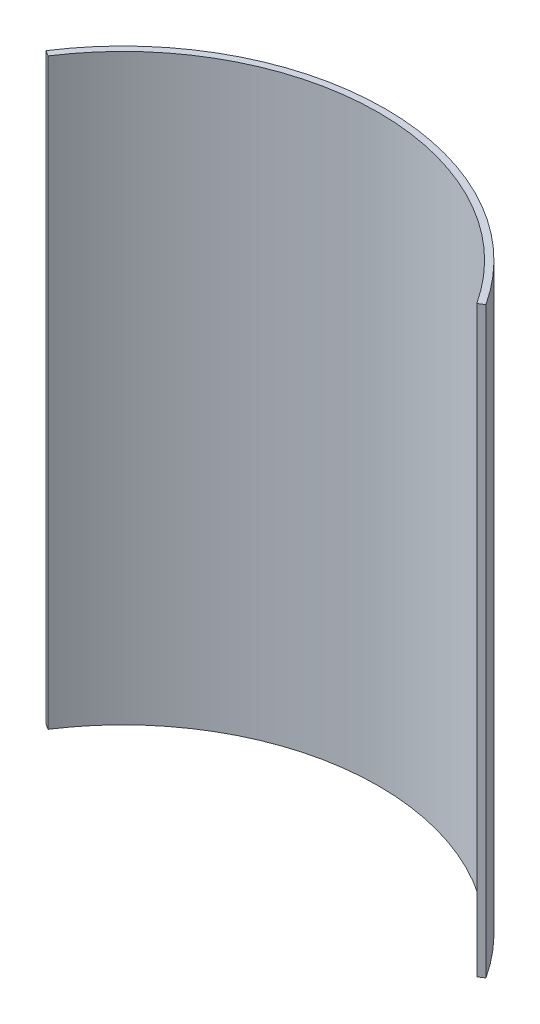
ISO-10303-21;
HEADER;
FILE_DESCRIPTION(('STEP AP214'),'2;1');
FILE_NAME('part.step','',(''),(''),'','','');
FILE_SCHEMA(('AUTOMOTIVE_DESIGN { 1 0 10303 214 1 1 1 1 }'));
ENDSEC;
DATA;
#1=APPLICATION_CONTEXT('core data for automotive mechanical design processes');
#2=APPLICATION_PROTOCOL_DEFINITION('international standard','automotive_design',2000,#1);
#3=PRODUCT_CONTEXT('',#1,'mechanical');
#4=PRODUCT('Part','Part','',(#3));
#5=PRODUCT_RELATED_PRODUCT_CATEGORY('part','',(#4));
#6=PRODUCT_DEFINITION_FORMATION('','',#4);
#7=PRODUCT_DEFINITION_CONTEXT('part definition',#1,'design');
#8=PRODUCT_DEFINITION('design','',#6,#7);
#9=PRODUCT_DEFINITION_SHAPE('','',#8);
#10=(LENGTH_UNIT() NAMED_UNIT(*) SI_UNIT(.MILLI.,.METRE.));
#11=(NAMED_UNIT(*) PLANE_ANGLE_UNIT() SI_UNIT($,.RADIAN.));
#12=(NAMED_UNIT(*) SI_UNIT($,.STERADIAN.) SOLID_ANGLE_UNIT());
#13=UNCERTAINTY_MEASURE_WITH_UNIT(LENGTH_MEASURE(1.E-05),#10,'distance_accuracy_value','');
#14=(GEOMETRIC_REPRESENTATION_CONTEXT(3) GLOBAL_UNCERTAINTY_ASSIGNED_CONTEXT((#13)) GLOBAL_UNIT_ASSIGNED_CONTEXT((#10,
#11,#12)) REPRESENTATION_CONTEXT('',''));
#15=CARTESIAN_POINT('',(0.,0.,0.));
#16=DIRECTION('',(0.,0.,1.));
#17=DIRECTION('',(1.,0.,0.));
#18=AXIS2_PLACEMENT_3D('',#15,#16,#17);
#19=CARTESIAN_POINT('',(0.,-85.5,0.));
#20=DIRECTION('',(0.,1.,0.));
#21=DIRECTION('',(0.,0.,1.));
#22=AXIS2_PLACEMENT_3D('',#19,#20,#21);
#23=CYLINDRICAL_SURFACE('',#22,37.5);
#24=CARTESIAN_POINT('',(0.,0.,0.));
#25=DIRECTION('',(0.,-1.,0.));
#26=DIRECTION('',(0.,0.,1.));
#27=AXIS2_PLACEMENT_3D('',#24,#25,#26);
#28=CIRCLE('',#27,37.5);
#29=CARTESIAN_POINT('',(-31.4300312322926,0.,-20.4549049554652));
#30=VERTEX_POINT('',#29);
#31=CARTESIAN_POINT('',(31.4300312322926,0.,-20.4549049554652));
#32=VERTEX_POINT('',#31);
#33=EDGE_CURVE('E99',#30,#32,#28,.T.);
#34=ORIENTED_EDGE('',*,*,#33,.F.);
#35=DIRECTION('',(0.,1.,0.));
#36=VECTOR('',#35,1.);
#37=CARTESIAN_POINT('',(-31.4300312322926,-85.5,-20.4549049554652));
#38=LINE('',#37,#36);
#39=CARTESIAN_POINT('',(-31.4300312322926,-85.5,-20.4549049554652));
#40=VERTEX_POINT('',#39);
#41=EDGE_CURVE('E11',#40,#30,#38,.T.);
#42=ORIENTED_EDGE('',*,*,#41,.F.);
#43=CARTESIAN_POINT('',(0.,-85.5,0.));
#44=DIRECTION('',(0.,-1.,0.));
#45=DIRECTION('',(0.,0.,1.));
#46=AXIS2_PLACEMENT_3D('',#43,#44,#45);
#47=CIRCLE('',#46,37.5);
#48=CARTESIAN_POINT('',(31.4300312322926,-85.5,-20.4549049554652));
#49=VERTEX_POINT('',#48);
#50=EDGE_CURVE('E93',#40,#49,#47,.T.);
#51=ORIENTED_EDGE('',*,*,#50,.T.);
#52=DIRECTION('',(0.,1.,0.));
#53=VECTOR('',#52,1.);
#54=CARTESIAN_POINT('',(31.4300312322926,-85.5,-20.4549049554652));
#55=LINE('',#54,#53);
#56=EDGE_CURVE('E38',#49,#32,#55,.T.);
#57=ORIENTED_EDGE('',*,*,#56,.T.);
#58=EDGE_LOOP('',(#34,#42,#51,#57));
#59=FACE_BOUND('',#58,.T.);
#60=ADVANCED_FACE('F35',(#59),#23,.F.);
#61=CARTESIAN_POINT('',(-31.4300312322926,-85.5,-20.4549049554652));
#62=DIRECTION('',(-0.545464132145742,0.,0.838134166194466));
#63=DIRECTION('',(0.838134166194466,0.,0.545464132145742));
#64=AXIS2_PLACEMENT_3D('',#61,#62,#63);
#65=PLANE('',#64);
#66=DIRECTION('',(0.838134166194466,0.,0.545464132145742));
#67=VECTOR('',#66,1.);
#68=CARTESIAN_POINT('',(-31.4300312322926,0.,-20.4549049554652));
#69=LINE('',#68,#67);
#70=CARTESIAN_POINT('',(-32.2436651639186,0.,-20.984424147379));
#71=VERTEX_POINT('',#70);
#72=EDGE_CURVE('E95',#71,#30,#69,.T.);
#73=ORIENTED_EDGE('',*,*,#72,.F.);
#74=DIRECTION('',(0.,1.,0.));
#75=VECTOR('',#74,1.);
#76=CARTESIAN_POINT('',(-32.2436651639186,-85.5,-20.984424147379));
#77=LINE('',#76,#75);
#78=CARTESIAN_POINT('',(-32.2436651639186,-85.5,-20.984424147379));
#79=VERTEX_POINT('',#78);
#80=EDGE_CURVE('E44',#79,#71,#77,.T.);
#81=ORIENTED_EDGE('',*,*,#80,.F.);
#82=DIRECTION('',(0.838134166194466,0.,0.545464132145742));
#83=VECTOR('',#82,1.);
#84=CARTESIAN_POINT('',(-31.4300312322926,-85.5,-20.4549049554652));
#85=LINE('',#84,#83);
#86=EDGE_CURVE('E90',#79,#40,#85,.T.);
#87=ORIENTED_EDGE('',*,*,#86,.T.);
#88=ORIENTED_EDGE('',*,*,#41,.T.);
#89=EDGE_LOOP('',(#73,#81,#87,#88));
#90=FACE_BOUND('',#89,.T.);
#91=ADVANCED_FACE('F109',(#90),#65,.T.);
#92=CARTESIAN_POINT('',(0.,-85.5,0.));
#93=DIRECTION('',(0.,1.,0.));
#94=DIRECTION('',(0.,0.,1.));
#95=AXIS2_PLACEMENT_3D('',#92,#93,#94);
#96=CYLINDRICAL_SURFACE('',#95,38.4707681233427);
#97=CARTESIAN_POINT('',(0.,0.,0.));
#98=DIRECTION('',(0.,1.,0.));
#99=DIRECTION('',(0.,0.,1.));
#100=AXIS2_PLACEMENT_3D('',#97,#98,#99);
#101=CIRCLE('',#100,38.4707681233427);
#102=CARTESIAN_POINT('',(32.2436651639185,0.,-20.9844241473791));
#103=VERTEX_POINT('',#102);
#104=EDGE_CURVE('E85',#103,#71,#101,.T.);
#105=ORIENTED_EDGE('',*,*,#104,.F.);
#106=DIRECTION('',(0.,1.,0.));
#107=VECTOR('',#106,1.);
#108=CARTESIAN_POINT('',(32.2436651639185,-85.5,-20.9844241473791));
#109=LINE('',#108,#107);
#110=CARTESIAN_POINT('',(32.2436651639185,-85.5,-20.9844241473791));
#111=VERTEX_POINT('',#110);
#112=EDGE_CURVE('E80',#111,#103,#109,.T.);
#113=ORIENTED_EDGE('',*,*,#112,.F.);
#114=CARTESIAN_POINT('',(0.,-85.5,0.));
#115=DIRECTION('',(0.,1.,0.));
#116=DIRECTION('',(0.,0.,1.));
#117=AXIS2_PLACEMENT_3D('',#114,#115,#116);
#118=CIRCLE('',#117,38.4707681233427);
#119=EDGE_CURVE('E83',#111,#79,#118,.T.);
#120=ORIENTED_EDGE('',*,*,#119,.T.);
#121=ORIENTED_EDGE('',*,*,#80,.T.);
#122=EDGE_LOOP('',(#105,#113,#120,#121));
#123=FACE_BOUND('',#122,.T.);
#124=ADVANCED_FACE('F82',(#123),#96,.T.);
#125=CARTESIAN_POINT('',(31.4300312322926,-85.5,-20.4549049554652));
#126=DIRECTION('',(0.545464132145742,0.,0.838134166194466));
#127=DIRECTION('',(0.838134166194466,0.,-0.545464132145742));
#128=AXIS2_PLACEMENT_3D('',#125,#126,#127);
#129=PLANE('',#128);
#130=DIRECTION('',(0.838134166194466,0.,-0.545464132145742));
#131=VECTOR('',#130,1.);
#132=CARTESIAN_POINT('',(31.4300312322926,0.,-20.4549049554652));
#133=LINE('',#132,#131);
#134=EDGE_CURVE('E102',#32,#103,#133,.T.);
#135=ORIENTED_EDGE('',*,*,#134,.F.);
#136=ORIENTED_EDGE('',*,*,#56,.F.);
#137=DIRECTION('',(0.838134166194466,0.,-0.545464132145742));
#138=VECTOR('',#137,1.);
#139=CARTESIAN_POINT('',(31.4300312322926,-85.5,-20.4549049554652));
#140=LINE('',#139,#138);
#141=EDGE_CURVE('E89',#49,#111,#140,.T.);
#142=ORIENTED_EDGE('',*,*,#141,.T.);
#143=ORIENTED_EDGE('',*,*,#112,.T.);
#144=EDGE_LOOP('',(#135,#136,#142,#143));
#145=FACE_BOUND('',#144,.T.);
#146=ADVANCED_FACE('F92',(#145),#129,.T.);
#147=CARTESIAN_POINT('',(0.,-85.5,0.));
#148=DIRECTION('',(0.,1.,0.));
#149=DIRECTION('',(0.,0.,1.));
#150=AXIS2_PLACEMENT_3D('',#147,#148,#149);
#151=PLANE('',#150);
#152=ORIENTED_EDGE('',*,*,#50,.F.);
#153=ORIENTED_EDGE('',*,*,#86,.F.);
#154=ORIENTED_EDGE('',*,*,#119,.F.);
#155=ORIENTED_EDGE('',*,*,#141,.F.);
#156=EDGE_LOOP('',(#152,#153,#154,#155));
#157=FACE_BOUND('',#156,.T.);
#158=ADVANCED_FACE('F88',(#157),#151,.F.);
#159=CARTESIAN_POINT('',(0.,0.,0.));
#160=DIRECTION('',(0.,1.,0.));
#161=DIRECTION('',(0.,0.,1.));
#162=AXIS2_PLACEMENT_3D('',#159,#160,#161);
#163=PLANE('',#162);
#164=ORIENTED_EDGE('',*,*,#33,.T.);
#165=ORIENTED_EDGE('',*,*,#134,.T.);
#166=ORIENTED_EDGE('',*,*,#104,.T.);
#167=ORIENTED_EDGE('',*,*,#72,.T.);
#168=EDGE_LOOP('',(#164,#165,#166,#167));
#169=FACE_BOUND('',#168,.T.);
#170=ADVANCED_FACE('F108',(#169),#163,.T.);
#171=CLOSED_SHELL('',(#60,#91,#124,#146,#158,#170));
#172=MANIFOLD_SOLID_BREP('B2',#171);
#173=ADVANCED_BREP_SHAPE_REPRESENTATION('',(#18,#172),#14);
#174=SHAPE_DEFINITION_REPRESENTATION(#9,#173);
ENDSEC;
END-ISO-10303-21;
